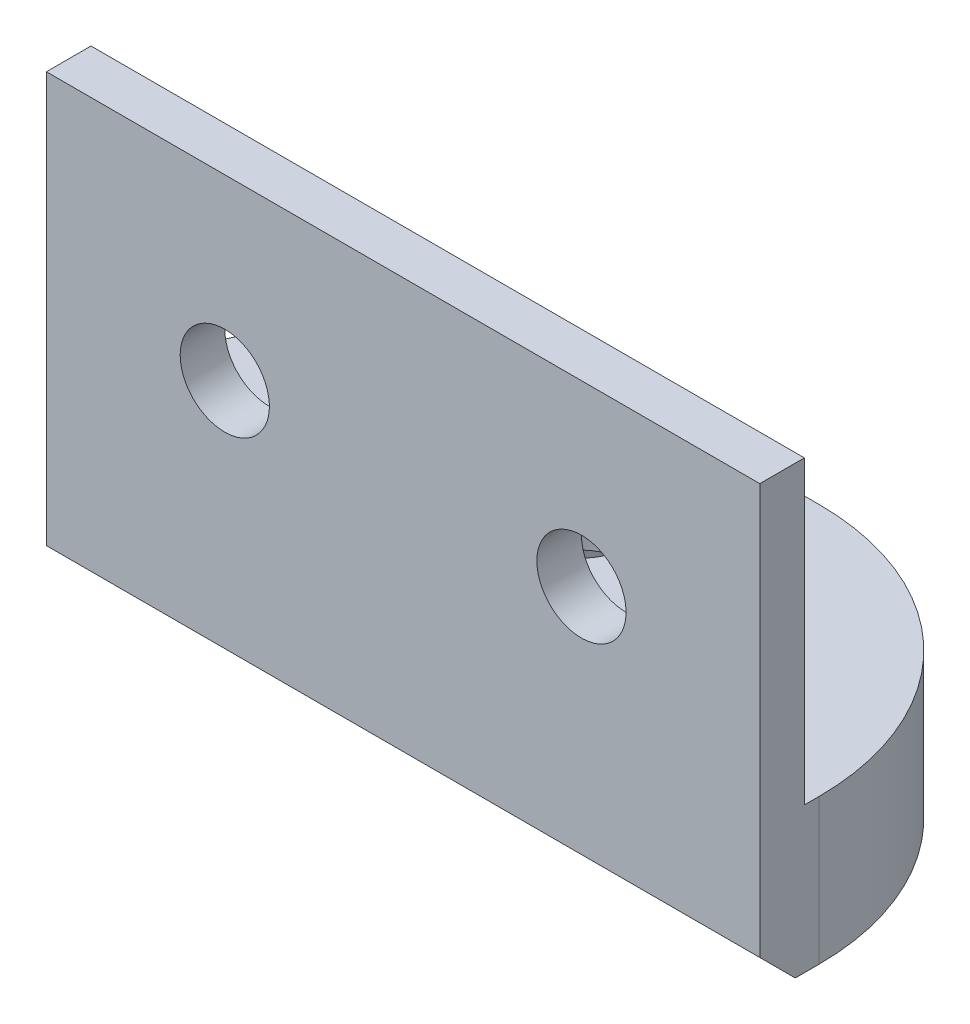
ISO-10303-21;
HEADER;
FILE_DESCRIPTION(('STEP AP214'),'2;1');
FILE_NAME('part.step','',(''),(''),'','','');
FILE_SCHEMA(('AUTOMOTIVE_DESIGN { 1 0 10303 214 1 1 1 1 }'));
ENDSEC;
DATA;
#1=APPLICATION_CONTEXT('core data for automotive mechanical design processes');
#2=APPLICATION_PROTOCOL_DEFINITION('international standard','automotive_design',2000,#1);
#3=PRODUCT_CONTEXT('',#1,'mechanical');
#4=PRODUCT('Part','Part','',(#3));
#5=PRODUCT_RELATED_PRODUCT_CATEGORY('part','',(#4));
#6=PRODUCT_DEFINITION_FORMATION('','',#4);
#7=PRODUCT_DEFINITION_CONTEXT('part definition',#1,'design');
#8=PRODUCT_DEFINITION('design','',#6,#7);
#9=PRODUCT_DEFINITION_SHAPE('','',#8);
#10=(LENGTH_UNIT() NAMED_UNIT(*) SI_UNIT(.MILLI.,.METRE.));
#11=(NAMED_UNIT(*) PLANE_ANGLE_UNIT() SI_UNIT($,.RADIAN.));
#12=(NAMED_UNIT(*) SI_UNIT($,.STERADIAN.) SOLID_ANGLE_UNIT());
#13=UNCERTAINTY_MEASURE_WITH_UNIT(LENGTH_MEASURE(1.E-05),#10,'distance_accuracy_value','');
#14=(GEOMETRIC_REPRESENTATION_CONTEXT(3) GLOBAL_UNCERTAINTY_ASSIGNED_CONTEXT((#13)) GLOBAL_UNIT_ASSIGNED_CONTEXT((#10,
#11,#12)) REPRESENTATION_CONTEXT('',''));
#15=CARTESIAN_POINT('',(0.,0.,0.));
#16=DIRECTION('',(0.,0.,1.));
#17=DIRECTION('',(1.,0.,0.));
#18=AXIS2_PLACEMENT_3D('',#15,#16,#17);
#19=CARTESIAN_POINT('',(0.,0.,0.));
#20=DIRECTION('',(0.,0.,-1.));
#21=DIRECTION('',(-1.,0.,0.));
#22=AXIS2_PLACEMENT_3D('',#19,#20,#21);
#23=PLANE('',#22);
#24=CARTESIAN_POINT('',(12.7,0.,0.));
#25=DIRECTION('',(0.,0.,-1.));
#26=DIRECTION('',(-1.,0.,0.));
#27=AXIS2_PLACEMENT_3D('',#24,#25,#26);
#28=CIRCLE('',#27,3.17499999999999);
#29=CARTESIAN_POINT('',(9.52499999999999,0.,0.));
#30=VERTEX_POINT('',#29);
#31=EDGE_CURVE('E253',#30,#30,#28,.T.);
#32=ORIENTED_EDGE('',*,*,#31,.F.);
#33=EDGE_LOOP('',(#32));
#34=FACE_BOUND('',#33,.T.);
#35=CARTESIAN_POINT('',(-12.7,0.,0.));
#36=DIRECTION('',(0.,0.,-1.));
#37=DIRECTION('',(-1.,0.,0.));
#38=AXIS2_PLACEMENT_3D('',#35,#36,#37);
#39=CIRCLE('',#38,3.17499999999999);
#40=CARTESIAN_POINT('',(-15.875,0.,0.));
#41=VERTEX_POINT('',#40);
#42=EDGE_CURVE('E261',#41,#41,#39,.T.);
#43=ORIENTED_EDGE('',*,*,#42,.F.);
#44=EDGE_LOOP('',(#43));
#45=FACE_BOUND('',#44,.T.);
#46=DIRECTION('',(0.,1.,0.));
#47=VECTOR('',#46,1.);
#48=CARTESIAN_POINT('',(25.4,-12.7,0.));
#49=LINE('',#48,#47);
#50=CARTESIAN_POINT('',(25.4,-8.7,0.));
#51=VERTEX_POINT('',#50);
#52=CARTESIAN_POINT('',(25.4,12.7,0.));
#53=VERTEX_POINT('',#52);
#54=EDGE_CURVE('E274',#51,#53,#49,.T.);
#55=ORIENTED_EDGE('',*,*,#54,.F.);
#56=DIRECTION('',(-1.,0.,0.));
#57=VECTOR('',#56,1.);
#58=CARTESIAN_POINT('',(0.,-8.7,0.));
#59=LINE('',#58,#57);
#60=CARTESIAN_POINT('',(-25.4,-8.7,0.));
#61=VERTEX_POINT('',#60);
#62=EDGE_CURVE('E219',#51,#61,#59,.T.);
#63=ORIENTED_EDGE('',*,*,#62,.T.);
#64=DIRECTION('',(0.,1.,0.));
#65=VECTOR('',#64,1.);
#66=CARTESIAN_POINT('',(-25.4,-12.7,0.));
#67=LINE('',#66,#65);
#68=CARTESIAN_POINT('',(-25.4,12.7,0.));
#69=VERTEX_POINT('',#68);
#70=EDGE_CURVE('E284',#61,#69,#67,.T.);
#71=ORIENTED_EDGE('',*,*,#70,.T.);
#72=DIRECTION('',(-1.,0.,0.));
#73=VECTOR('',#72,1.);
#74=CARTESIAN_POINT('',(25.4,12.7,0.));
#75=LINE('',#74,#73);
#76=EDGE_CURVE('E269',#53,#69,#75,.T.);
#77=ORIENTED_EDGE('',*,*,#76,.F.);
#78=EDGE_LOOP('',(#55,#63,#71,#77));
#79=FACE_BOUND('',#78,.T.);
#80=ADVANCED_FACE('F43',(#34,#45,#79),#23,.T.);
#81=CARTESIAN_POINT('',(25.4,12.7,3.175));
#82=DIRECTION('',(0.,-1.,0.));
#83=DIRECTION('',(1.,0.,0.));
#84=AXIS2_PLACEMENT_3D('',#81,#82,#83);
#85=PLANE('',#84);
#86=ORIENTED_EDGE('',*,*,#76,.T.);
#87=DIRECTION('',(0.,0.,-1.));
#88=VECTOR('',#87,1.);
#89=CARTESIAN_POINT('',(-25.4,12.7,3.175));
#90=LINE('',#89,#88);
#91=CARTESIAN_POINT('',(-25.4,12.7,3.175));
#92=VERTEX_POINT('',#91);
#93=EDGE_CURVE('E292',#92,#69,#90,.T.);
#94=ORIENTED_EDGE('',*,*,#93,.F.);
#95=DIRECTION('',(-1.,0.,0.));
#96=VECTOR('',#95,1.);
#97=CARTESIAN_POINT('',(25.4,12.7,3.175));
#98=LINE('',#97,#96);
#99=CARTESIAN_POINT('',(25.4,12.7,3.175));
#100=VERTEX_POINT('',#99);
#101=EDGE_CURVE('E270',#100,#92,#98,.T.);
#102=ORIENTED_EDGE('',*,*,#101,.F.);
#103=DIRECTION('',(0.,0.,-1.));
#104=VECTOR('',#103,1.);
#105=CARTESIAN_POINT('',(25.4,12.7,3.175));
#106=LINE('',#105,#104);
#107=EDGE_CURVE('E280',#100,#53,#106,.T.);
#108=ORIENTED_EDGE('',*,*,#107,.T.);
#109=EDGE_LOOP('',(#86,#94,#102,#108));
#110=FACE_BOUND('',#109,.T.);
#111=ADVANCED_FACE('F370',(#110),#85,.F.);
#112=CARTESIAN_POINT('',(-25.4,-12.7,3.175));
#113=DIRECTION('',(-1.,0.,0.));
#114=DIRECTION('',(0.,-1.,0.));
#115=AXIS2_PLACEMENT_3D('',#112,#113,#114);
#116=PLANE('',#115);
#117=DIRECTION('',(0.,0.,1.));
#118=VECTOR('',#117,1.);
#119=CARTESIAN_POINT('',(-25.4,-8.7,-19.05));
#120=LINE('',#119,#118);
#121=CARTESIAN_POINT('',(-25.4,-8.7,-1.05000000000001));
#122=VERTEX_POINT('',#121);
#123=EDGE_CURVE('E250',#122,#61,#120,.T.);
#124=ORIENTED_EDGE('',*,*,#123,.F.);
#125=DIRECTION('',(0.,-1.,0.));
#126=VECTOR('',#125,1.);
#127=CARTESIAN_POINT('',(-25.4,-12.7,-1.05));
#128=LINE('',#127,#126);
#129=CARTESIAN_POINT('',(-25.4,-19.05,-1.05000000000001));
#130=VERTEX_POINT('',#129);
#131=EDGE_CURVE('E296',#122,#130,#128,.T.);
#132=ORIENTED_EDGE('',*,*,#131,.T.);
#133=DIRECTION('',(0.,0.,1.));
#134=VECTOR('',#133,1.);
#135=CARTESIAN_POINT('',(-25.4,-19.05,-19.05));
#136=LINE('',#135,#134);
#137=CARTESIAN_POINT('',(-25.4,-19.05,0.650000000000119));
#138=VERTEX_POINT('',#137);
#139=EDGE_CURVE('E239',#130,#138,#136,.T.);
#140=ORIENTED_EDGE('',*,*,#139,.T.);
#141=DIRECTION('',(0.,0.707106781186551,0.707106781186544));
#142=VECTOR('',#141,1.);
#143=CARTESIAN_POINT('',(-25.4,-19.7000000000001,0.));
#144=LINE('',#143,#142);
#145=CARTESIAN_POINT('',(-25.4,-16.5250000000001,3.175));
#146=VERTEX_POINT('',#145);
#147=EDGE_CURVE('E329',#138,#146,#144,.T.);
#148=ORIENTED_EDGE('',*,*,#147,.T.);
#149=DIRECTION('',(0.,1.,0.));
#150=VECTOR('',#149,1.);
#151=CARTESIAN_POINT('',(-25.4,-12.7,3.175));
#152=LINE('',#151,#150);
#153=EDGE_CURVE('E273',#146,#92,#152,.T.);
#154=ORIENTED_EDGE('',*,*,#153,.T.);
#155=ORIENTED_EDGE('',*,*,#93,.T.);
#156=ORIENTED_EDGE('',*,*,#70,.F.);
#157=EDGE_LOOP('',(#124,#132,#140,#148,#154,#155,#156));
#158=FACE_BOUND('',#157,.T.);
#159=ADVANCED_FACE('F362',(#158),#116,.T.);
#160=CARTESIAN_POINT('',(25.4,-12.7,3.175));
#161=DIRECTION('',(-1.,0.,0.));
#162=DIRECTION('',(0.,0.,1.));
#163=AXIS2_PLACEMENT_3D('',#160,#161,#162);
#164=PLANE('',#163);
#165=DIRECTION('',(0.,0.,1.));
#166=VECTOR('',#165,1.);
#167=CARTESIAN_POINT('',(25.4,-19.05,-19.05));
#168=LINE('',#167,#166);
#169=CARTESIAN_POINT('',(25.4,-19.05,-1.05000000000001));
#170=VERTEX_POINT('',#169);
#171=CARTESIAN_POINT('',(25.4,-19.05,0.65000000000012));
#172=VERTEX_POINT('',#171);
#173=EDGE_CURVE('E60',#170,#172,#168,.T.);
#174=ORIENTED_EDGE('',*,*,#173,.F.);
#175=DIRECTION('',(0.,-1.,0.));
#176=VECTOR('',#175,1.);
#177=CARTESIAN_POINT('',(25.4,-8.7,-1.05));
#178=LINE('',#177,#176);
#179=CARTESIAN_POINT('',(25.4,-8.7,-1.05000000000001));
#180=VERTEX_POINT('',#179);
#181=EDGE_CURVE('E323',#170,#180,#178,.F.);
#182=ORIENTED_EDGE('',*,*,#181,.T.);
#183=DIRECTION('',(0.,0.,1.));
#184=VECTOR('',#183,1.);
#185=CARTESIAN_POINT('',(25.4,-8.7,-19.05));
#186=LINE('',#185,#184);
#187=EDGE_CURVE('E247',#180,#51,#186,.T.);
#188=ORIENTED_EDGE('',*,*,#187,.T.);
#189=ORIENTED_EDGE('',*,*,#54,.T.);
#190=ORIENTED_EDGE('',*,*,#107,.F.);
#191=DIRECTION('',(0.,1.,0.));
#192=VECTOR('',#191,1.);
#193=CARTESIAN_POINT('',(25.4,-12.7,3.175));
#194=LINE('',#193,#192);
#195=CARTESIAN_POINT('',(25.4,-16.5250000000001,3.175));
#196=VERTEX_POINT('',#195);
#197=EDGE_CURVE('E67',#196,#100,#194,.T.);
#198=ORIENTED_EDGE('',*,*,#197,.F.);
#199=DIRECTION('',(0.,-0.707106781186551,-0.707106781186544));
#200=VECTOR('',#199,1.);
#201=CARTESIAN_POINT('',(25.4,-14.6125,5.08750000000004));
#202=LINE('',#201,#200);
#203=EDGE_CURVE('E11',#196,#172,#202,.T.);
#204=ORIENTED_EDGE('',*,*,#203,.T.);
#205=EDGE_LOOP('',(#174,#182,#188,#189,#190,#198,#204));
#206=FACE_BOUND('',#205,.T.);
#207=ADVANCED_FACE('F340',(#206),#164,.F.);
#208=CARTESIAN_POINT('',(0.,0.,3.175));
#209=DIRECTION('',(0.,0.,-1.));
#210=DIRECTION('',(-1.,0.,0.));
#211=AXIS2_PLACEMENT_3D('',#208,#209,#210);
#212=PLANE('',#211);
#213=CARTESIAN_POINT('',(12.7,0.,3.175));
#214=DIRECTION('',(0.,0.,-1.));
#215=DIRECTION('',(-1.,0.,0.));
#216=AXIS2_PLACEMENT_3D('',#213,#214,#215);
#217=CIRCLE('',#216,3.17499999999999);
#218=CARTESIAN_POINT('',(9.52499999999999,0.,3.175));
#219=VERTEX_POINT('',#218);
#220=EDGE_CURVE('E257',#219,#219,#217,.T.);
#221=ORIENTED_EDGE('',*,*,#220,.T.);
#222=EDGE_LOOP('',(#221));
#223=FACE_BOUND('',#222,.T.);
#224=CARTESIAN_POINT('',(-12.7,0.,3.175));
#225=DIRECTION('',(0.,0.,-1.));
#226=DIRECTION('',(-1.,0.,0.));
#227=AXIS2_PLACEMENT_3D('',#224,#225,#226);
#228=CIRCLE('',#227,3.17499999999999);
#229=CARTESIAN_POINT('',(-15.875,0.,3.175));
#230=VERTEX_POINT('',#229);
#231=EDGE_CURVE('E265',#230,#230,#228,.T.);
#232=ORIENTED_EDGE('',*,*,#231,.T.);
#233=EDGE_LOOP('',(#232));
#234=FACE_BOUND('',#233,.T.);
#235=ORIENTED_EDGE('',*,*,#101,.T.);
#236=ORIENTED_EDGE('',*,*,#153,.F.);
#237=DIRECTION('',(1.,0.,0.));
#238=VECTOR('',#237,1.);
#239=CARTESIAN_POINT('',(0.,-16.5250000000001,3.175));
#240=LINE('',#239,#238);
#241=EDGE_CURVE('E53',#146,#196,#240,.T.);
#242=ORIENTED_EDGE('',*,*,#241,.T.);
#243=ORIENTED_EDGE('',*,*,#197,.T.);
#244=EDGE_LOOP('',(#235,#236,#242,#243));
#245=FACE_BOUND('',#244,.T.);
#246=ADVANCED_FACE('F336',(#223,#234,#245),#212,.F.);
#247=CARTESIAN_POINT('',(-12.7,0.,0.));
#248=DIRECTION('',(0.,0.,-1.));
#249=DIRECTION('',(-1.,0.,0.));
#250=AXIS2_PLACEMENT_3D('',#247,#248,#249);
#251=CYLINDRICAL_SURFACE('',#250,3.17499999999999);
#252=ORIENTED_EDGE('',*,*,#231,.F.);
#253=EDGE_LOOP('',(#252));
#254=FACE_BOUND('',#253,.T.);
#255=ORIENTED_EDGE('',*,*,#42,.T.);
#256=EDGE_LOOP('',(#255));
#257=FACE_BOUND('',#256,.T.);
#258=ADVANCED_FACE('F423',(#254,#257),#251,.F.);
#259=CARTESIAN_POINT('',(12.7,0.,0.));
#260=DIRECTION('',(0.,0.,-1.));
#261=DIRECTION('',(-1.,0.,0.));
#262=AXIS2_PLACEMENT_3D('',#259,#260,#261);
#263=CYLINDRICAL_SURFACE('',#262,3.17499999999999);
#264=ORIENTED_EDGE('',*,*,#220,.F.);
#265=EDGE_LOOP('',(#264));
#266=FACE_BOUND('',#265,.T.);
#267=ORIENTED_EDGE('',*,*,#31,.T.);
#268=EDGE_LOOP('',(#267));
#269=FACE_BOUND('',#268,.T.);
#270=ADVANCED_FACE('F380',(#266,#269),#263,.F.);
#271=CARTESIAN_POINT('',(0.,-8.7,-19.05));
#272=DIRECTION('',(0.,1.,0.));
#273=DIRECTION('',(0.,0.,1.));
#274=AXIS2_PLACEMENT_3D('',#271,#272,#273);
#275=PLANE('',#274);
#276=CARTESIAN_POINT('',(0.,-8.7,-9.525));
#277=DIRECTION('',(0.,1.,0.));
#278=DIRECTION('',(0.,0.,1.));
#279=AXIS2_PLACEMENT_3D('',#276,#277,#278);
#280=CIRCLE('',#279,3.17499999999999);
#281=CARTESIAN_POINT('',(0.,-8.7,-6.35000000000002));
#282=VERTEX_POINT('',#281);
#283=EDGE_CURVE('E187',#282,#282,#280,.T.);
#284=ORIENTED_EDGE('',*,*,#283,.F.);
#285=EDGE_LOOP('',(#284));
#286=FACE_BOUND('',#285,.T.);
#287=DIRECTION('',(-1.,0.,0.));
#288=VECTOR('',#287,1.);
#289=CARTESIAN_POINT('',(0.,-8.7,-19.05));
#290=LINE('',#289,#288);
#291=CARTESIAN_POINT('',(7.39999999999998,-8.7,-19.05));
#292=VERTEX_POINT('',#291);
#293=CARTESIAN_POINT('',(-7.40000000000002,-8.7,-19.05));
#294=VERTEX_POINT('',#293);
#295=EDGE_CURVE('E231',#292,#294,#290,.T.);
#296=ORIENTED_EDGE('',*,*,#295,.T.);
#297=CARTESIAN_POINT('',(-7.40000000000002,-8.7,-1.05));
#298=DIRECTION('',(0.,1.,0.));
#299=DIRECTION('',(0.,0.,1.));
#300=AXIS2_PLACEMENT_3D('',#297,#298,#299);
#301=CIRCLE('',#300,18.);
#302=EDGE_CURVE('E320',#294,#122,#301,.T.);
#303=ORIENTED_EDGE('',*,*,#302,.T.);
#304=ORIENTED_EDGE('',*,*,#123,.T.);
#305=ORIENTED_EDGE('',*,*,#62,.F.);
#306=ORIENTED_EDGE('',*,*,#187,.F.);
#307=CARTESIAN_POINT('',(7.39999999999998,-8.7,-1.05));
#308=DIRECTION('',(0.,1.,0.));
#309=DIRECTION('',(0.,0.,1.));
#310=AXIS2_PLACEMENT_3D('',#307,#308,#309);
#311=CIRCLE('',#310,18.);
#312=EDGE_CURVE('E317',#180,#292,#311,.T.);
#313=ORIENTED_EDGE('',*,*,#312,.T.);
#314=EDGE_LOOP('',(#296,#303,#304,#305,#306,#313));
#315=FACE_BOUND('',#314,.T.);
#316=ADVANCED_FACE('F349',(#286,#315),#275,.T.);
#317=CARTESIAN_POINT('',(0.,-19.05,-19.05));
#318=DIRECTION('',(0.,1.,0.));
#319=DIRECTION('',(0.,0.,1.));
#320=AXIS2_PLACEMENT_3D('',#317,#318,#319);
#321=PLANE('',#320);
#322=DIRECTION('',(1.,0.,0.));
#323=VECTOR('',#322,1.);
#324=CARTESIAN_POINT('',(-3.29955678841873,-19.05,-15.24));
#325=LINE('',#324,#323);
#326=CARTESIAN_POINT('',(-3.29955678841873,-19.05,-15.24));
#327=VERTEX_POINT('',#326);
#328=CARTESIAN_POINT('',(3.29955678841869,-19.05,-15.24));
#329=VERTEX_POINT('',#328);
#330=EDGE_CURVE('E202',#327,#329,#325,.T.);
#331=ORIENTED_EDGE('',*,*,#330,.F.);
#332=DIRECTION('',(0.5,0.,-0.866025403784438));
#333=VECTOR('',#332,1.);
#334=CARTESIAN_POINT('',(-6.59911357683744,-19.05,-9.525));
#335=LINE('',#334,#333);
#336=CARTESIAN_POINT('',(-6.59911357683744,-19.05,-9.525));
#337=VERTEX_POINT('',#336);
#338=EDGE_CURVE('E159',#337,#327,#335,.T.);
#339=ORIENTED_EDGE('',*,*,#338,.F.);
#340=DIRECTION('',(-0.5,0.,-0.866025403784439));
#341=VECTOR('',#340,1.);
#342=CARTESIAN_POINT('',(-3.29955678841873,-19.05,-3.81000000000001));
#343=LINE('',#342,#341);
#344=CARTESIAN_POINT('',(-3.29955678841873,-19.05,-3.81000000000001));
#345=VERTEX_POINT('',#344);
#346=EDGE_CURVE('E180',#345,#337,#343,.T.);
#347=ORIENTED_EDGE('',*,*,#346,.F.);
#348=DIRECTION('',(-1.,0.,0.));
#349=VECTOR('',#348,1.);
#350=CARTESIAN_POINT('',(3.29955678841869,-19.05,-3.81));
#351=LINE('',#350,#349);
#352=CARTESIAN_POINT('',(3.29955678841869,-19.05,-3.81));
#353=VERTEX_POINT('',#352);
#354=EDGE_CURVE('E184',#353,#345,#351,.T.);
#355=ORIENTED_EDGE('',*,*,#354,.F.);
#356=DIRECTION('',(-0.500000000000001,0.,0.866025403784438));
#357=VECTOR('',#356,1.);
#358=CARTESIAN_POINT('',(6.5991135768374,-19.05,-9.525));
#359=LINE('',#358,#357);
#360=CARTESIAN_POINT('',(6.5991135768374,-19.05,-9.525));
#361=VERTEX_POINT('',#360);
#362=EDGE_CURVE('E209',#361,#353,#359,.T.);
#363=ORIENTED_EDGE('',*,*,#362,.F.);
#364=DIRECTION('',(0.5,0.,0.866025403784439));
#365=VECTOR('',#364,1.);
#366=CARTESIAN_POINT('',(3.29955678841869,-19.05,-15.24));
#367=LINE('',#366,#365);
#368=EDGE_CURVE('E205',#329,#361,#367,.T.);
#369=ORIENTED_EDGE('',*,*,#368,.F.);
#370=EDGE_LOOP('',(#331,#339,#347,#355,#363,#369));
#371=FACE_BOUND('',#370,.T.);
#372=ORIENTED_EDGE('',*,*,#139,.F.);
#373=CARTESIAN_POINT('',(-7.40000000000002,-19.05,-1.05));
#374=DIRECTION('',(0.,1.,0.));
#375=DIRECTION('',(0.,0.,1.));
#376=AXIS2_PLACEMENT_3D('',#373,#374,#375);
#377=CIRCLE('',#376,18.);
#378=CARTESIAN_POINT('',(-7.40000000000002,-19.05,-19.05));
#379=VERTEX_POINT('',#378);
#380=EDGE_CURVE('E307',#130,#379,#377,.F.);
#381=ORIENTED_EDGE('',*,*,#380,.T.);
#382=DIRECTION('',(-1.,0.,0.));
#383=VECTOR('',#382,1.);
#384=CARTESIAN_POINT('',(0.,-19.05,-19.05));
#385=LINE('',#384,#383);
#386=CARTESIAN_POINT('',(7.39999999999998,-19.05,-19.05));
#387=VERTEX_POINT('',#386);
#388=EDGE_CURVE('E235',#387,#379,#385,.T.);
#389=ORIENTED_EDGE('',*,*,#388,.F.);
#390=CARTESIAN_POINT('',(7.39999999999998,-19.05,-1.05));
#391=DIRECTION('',(0.,1.,0.));
#392=DIRECTION('',(0.,0.,1.));
#393=AXIS2_PLACEMENT_3D('',#390,#391,#392);
#394=CIRCLE('',#393,18.);
#395=EDGE_CURVE('E304',#387,#170,#394,.F.);
#396=ORIENTED_EDGE('',*,*,#395,.T.);
#397=ORIENTED_EDGE('',*,*,#173,.T.);
#398=DIRECTION('',(-1.,0.,0.));
#399=VECTOR('',#398,1.);
#400=CARTESIAN_POINT('',(0.,-19.05,0.650000000000123));
#401=LINE('',#400,#399);
#402=EDGE_CURVE('E326',#172,#138,#401,.T.);
#403=ORIENTED_EDGE('',*,*,#402,.T.);
#404=EDGE_LOOP('',(#372,#381,#389,#396,#397,#403));
#405=FACE_BOUND('',#404,.T.);
#406=ADVANCED_FACE('F371',(#371,#405),#321,.F.);
#407=CARTESIAN_POINT('',(0.,0.,-19.05));
#408=DIRECTION('',(0.,0.,-1.));
#409=DIRECTION('',(-1.,0.,0.));
#410=AXIS2_PLACEMENT_3D('',#407,#408,#409);
#411=PLANE('',#410);
#412=ORIENTED_EDGE('',*,*,#388,.T.);
#413=DIRECTION('',(0.,-1.,0.));
#414=VECTOR('',#413,1.);
#415=CARTESIAN_POINT('',(-7.40000000000002,0.,-19.05));
#416=LINE('',#415,#414);
#417=EDGE_CURVE('E314',#379,#294,#416,.F.);
#418=ORIENTED_EDGE('',*,*,#417,.T.);
#419=ORIENTED_EDGE('',*,*,#295,.F.);
#420=DIRECTION('',(0.,-1.,0.));
#421=VECTOR('',#420,1.);
#422=CARTESIAN_POINT('',(7.39999999999998,-19.05,-19.05));
#423=LINE('',#422,#421);
#424=EDGE_CURVE('E310',#292,#387,#423,.T.);
#425=ORIENTED_EDGE('',*,*,#424,.T.);
#426=EDGE_LOOP('',(#412,#418,#419,#425));
#427=FACE_BOUND('',#426,.T.);
#428=ADVANCED_FACE('F353',(#427),#411,.T.);
#429=CARTESIAN_POINT('',(-6.59911357683744,-12.7,-9.525));
#430=DIRECTION('',(-0.866025403784439,0.,-0.5));
#431=DIRECTION('',(-0.5,0.,0.866025403784439));
#432=AXIS2_PLACEMENT_3D('',#429,#430,#431);
#433=PLANE('',#432);
#434=ORIENTED_EDGE('',*,*,#338,.T.);
#435=DIRECTION('',(0.,-1.,0.));
#436=VECTOR('',#435,1.);
#437=CARTESIAN_POINT('',(-3.29955678841873,-12.7,-15.24));
#438=LINE('',#437,#436);
#439=CARTESIAN_POINT('',(-3.29955678841873,-12.7,-15.24));
#440=VERTEX_POINT('',#439);
#441=EDGE_CURVE('E152',#440,#327,#438,.T.);
#442=ORIENTED_EDGE('',*,*,#441,.F.);
#443=DIRECTION('',(0.5,0.,-0.866025403784438));
#444=VECTOR('',#443,1.);
#445=CARTESIAN_POINT('',(-6.59911357683744,-12.7,-9.525));
#446=LINE('',#445,#444);
#447=CARTESIAN_POINT('',(-6.59911357683744,-12.7,-9.525));
#448=VERTEX_POINT('',#447);
#449=EDGE_CURVE('E156',#448,#440,#446,.T.);
#450=ORIENTED_EDGE('',*,*,#449,.F.);
#451=DIRECTION('',(0.,-1.,0.));
#452=VECTOR('',#451,1.);
#453=CARTESIAN_POINT('',(-6.59911357683744,-12.7,-9.525));
#454=LINE('',#453,#452);
#455=EDGE_CURVE('E216',#448,#337,#454,.T.);
#456=ORIENTED_EDGE('',*,*,#455,.T.);
#457=EDGE_LOOP('',(#434,#442,#450,#456));
#458=FACE_BOUND('',#457,.T.);
#459=ADVANCED_FACE('F154',(#458),#433,.F.);
#460=CARTESIAN_POINT('',(-3.29955678841873,-12.7,-3.81000000000001));
#461=DIRECTION('',(-0.866025403784439,0.,0.5));
#462=DIRECTION('',(0.5,0.,0.866025403784439));
#463=AXIS2_PLACEMENT_3D('',#460,#461,#462);
#464=PLANE('',#463);
#465=ORIENTED_EDGE('',*,*,#346,.T.);
#466=ORIENTED_EDGE('',*,*,#455,.F.);
#467=DIRECTION('',(-0.5,0.,-0.866025403784439));
#468=VECTOR('',#467,1.);
#469=CARTESIAN_POINT('',(-3.29955678841873,-12.7,-3.81000000000001));
#470=LINE('',#469,#468);
#471=CARTESIAN_POINT('',(-3.29955678841873,-12.7,-3.81000000000001));
#472=VERTEX_POINT('',#471);
#473=EDGE_CURVE('E165',#472,#448,#470,.T.);
#474=ORIENTED_EDGE('',*,*,#473,.F.);
#475=DIRECTION('',(0.,-1.,0.));
#476=VECTOR('',#475,1.);
#477=CARTESIAN_POINT('',(-3.29955678841873,-12.7,-3.81000000000001));
#478=LINE('',#477,#476);
#479=EDGE_CURVE('E220',#472,#345,#478,.T.);
#480=ORIENTED_EDGE('',*,*,#479,.T.);
#481=EDGE_LOOP('',(#465,#466,#474,#480));
#482=FACE_BOUND('',#481,.T.);
#483=ADVANCED_FACE('F520',(#482),#464,.F.);
#484=CARTESIAN_POINT('',(3.29955678841869,-12.7,-3.81));
#485=DIRECTION('',(0.,0.,1.));
#486=DIRECTION('',(1.,0.,0.));
#487=AXIS2_PLACEMENT_3D('',#484,#485,#486);
#488=PLANE('',#487);
#489=ORIENTED_EDGE('',*,*,#354,.T.);
#490=ORIENTED_EDGE('',*,*,#479,.F.);
#491=DIRECTION('',(-1.,0.,0.));
#492=VECTOR('',#491,1.);
#493=CARTESIAN_POINT('',(3.29955678841869,-12.7,-3.81));
#494=LINE('',#493,#492);
#495=CARTESIAN_POINT('',(3.29955678841869,-12.7,-3.81));
#496=VERTEX_POINT('',#495);
#497=EDGE_CURVE('E195',#496,#472,#494,.T.);
#498=ORIENTED_EDGE('',*,*,#497,.F.);
#499=DIRECTION('',(0.,-1.,0.));
#500=VECTOR('',#499,1.);
#501=CARTESIAN_POINT('',(3.29955678841869,-12.7,-3.81));
#502=LINE('',#501,#500);
#503=EDGE_CURVE('E223',#496,#353,#502,.T.);
#504=ORIENTED_EDGE('',*,*,#503,.T.);
#505=EDGE_LOOP('',(#489,#490,#498,#504));
#506=FACE_BOUND('',#505,.T.);
#507=ADVANCED_FACE('F510',(#506),#488,.F.);
#508=CARTESIAN_POINT('',(6.5991135768374,-12.7,-9.525));
#509=DIRECTION('',(0.866025403784438,0.,0.500000000000001));
#510=DIRECTION('',(0.500000000000001,0.,-0.866025403784438));
#511=AXIS2_PLACEMENT_3D('',#508,#509,#510);
#512=PLANE('',#511);
#513=ORIENTED_EDGE('',*,*,#362,.T.);
#514=ORIENTED_EDGE('',*,*,#503,.F.);
#515=DIRECTION('',(-0.500000000000001,0.,0.866025403784438));
#516=VECTOR('',#515,1.);
#517=CARTESIAN_POINT('',(6.5991135768374,-12.7,-9.525));
#518=LINE('',#517,#516);
#519=CARTESIAN_POINT('',(6.5991135768374,-12.7,-9.525));
#520=VERTEX_POINT('',#519);
#521=EDGE_CURVE('E191',#520,#496,#518,.T.);
#522=ORIENTED_EDGE('',*,*,#521,.F.);
#523=DIRECTION('',(0.,-1.,0.));
#524=VECTOR('',#523,1.);
#525=CARTESIAN_POINT('',(6.5991135768374,-12.7,-9.525));
#526=LINE('',#525,#524);
#527=EDGE_CURVE('E226',#520,#361,#526,.T.);
#528=ORIENTED_EDGE('',*,*,#527,.T.);
#529=EDGE_LOOP('',(#513,#514,#522,#528));
#530=FACE_BOUND('',#529,.T.);
#531=ADVANCED_FACE('F500',(#530),#512,.F.);
#532=CARTESIAN_POINT('',(3.29955678841869,-12.7,-15.24));
#533=DIRECTION('',(0.866025403784439,0.,-0.5));
#534=DIRECTION('',(-0.5,0.,-0.866025403784439));
#535=AXIS2_PLACEMENT_3D('',#532,#533,#534);
#536=PLANE('',#535);
#537=ORIENTED_EDGE('',*,*,#368,.T.);
#538=ORIENTED_EDGE('',*,*,#527,.F.);
#539=DIRECTION('',(0.5,0.,0.866025403784439));
#540=VECTOR('',#539,1.);
#541=CARTESIAN_POINT('',(3.29955678841869,-12.7,-15.24));
#542=LINE('',#541,#540);
#543=CARTESIAN_POINT('',(3.29955678841869,-12.7,-15.24));
#544=VERTEX_POINT('',#543);
#545=EDGE_CURVE('E174',#544,#520,#542,.T.);
#546=ORIENTED_EDGE('',*,*,#545,.F.);
#547=DIRECTION('',(0.,-1.,0.));
#548=VECTOR('',#547,1.);
#549=CARTESIAN_POINT('',(3.29955678841869,-12.7,-15.24));
#550=LINE('',#549,#548);
#551=EDGE_CURVE('E164',#544,#329,#550,.T.);
#552=ORIENTED_EDGE('',*,*,#551,.T.);
#553=EDGE_LOOP('',(#537,#538,#546,#552));
#554=FACE_BOUND('',#553,.T.);
#555=ADVANCED_FACE('F491',(#554),#536,.F.);
#556=CARTESIAN_POINT('',(-3.29955678841873,-12.7,-15.24));
#557=DIRECTION('',(0.,0.,-1.));
#558=DIRECTION('',(-1.,0.,0.));
#559=AXIS2_PLACEMENT_3D('',#556,#557,#558);
#560=PLANE('',#559);
#561=ORIENTED_EDGE('',*,*,#330,.T.);
#562=ORIENTED_EDGE('',*,*,#551,.F.);
#563=DIRECTION('',(1.,0.,0.));
#564=VECTOR('',#563,1.);
#565=CARTESIAN_POINT('',(-3.29955678841873,-12.7,-15.24));
#566=LINE('',#565,#564);
#567=EDGE_CURVE('E168',#440,#544,#566,.T.);
#568=ORIENTED_EDGE('',*,*,#567,.F.);
#569=ORIENTED_EDGE('',*,*,#441,.T.);
#570=EDGE_LOOP('',(#561,#562,#568,#569));
#571=FACE_BOUND('',#570,.T.);
#572=ADVANCED_FACE('F169',(#571),#560,.F.);
#573=CARTESIAN_POINT('',(0.,-12.7,0.));
#574=DIRECTION('',(0.,-1.,0.));
#575=DIRECTION('',(0.,0.,-1.));
#576=AXIS2_PLACEMENT_3D('',#573,#574,#575);
#577=PLANE('',#576);
#578=CARTESIAN_POINT('',(0.,-12.7,-9.525));
#579=DIRECTION('',(0.,-1.,0.));
#580=DIRECTION('',(0.,0.,-1.));
#581=AXIS2_PLACEMENT_3D('',#578,#579,#580);
#582=CIRCLE('',#581,3.17499999999999);
#583=CARTESIAN_POINT('',(0.,-12.7,-12.7));
#584=VERTEX_POINT('',#583);
#585=EDGE_CURVE('E297',#584,#584,#582,.T.);
#586=ORIENTED_EDGE('',*,*,#585,.F.);
#587=EDGE_LOOP('',(#586));
#588=FACE_BOUND('',#587,.T.);
#589=ORIENTED_EDGE('',*,*,#449,.T.);
#590=ORIENTED_EDGE('',*,*,#567,.T.);
#591=ORIENTED_EDGE('',*,*,#545,.T.);
#592=ORIENTED_EDGE('',*,*,#521,.T.);
#593=ORIENTED_EDGE('',*,*,#497,.T.);
#594=ORIENTED_EDGE('',*,*,#473,.T.);
#595=EDGE_LOOP('',(#589,#590,#591,#592,#593,#594));
#596=FACE_BOUND('',#595,.T.);
#597=ADVANCED_FACE('F176',(#588,#596),#577,.T.);
#598=CARTESIAN_POINT('',(0.,-19.05,-9.525));
#599=DIRECTION('',(0.,-1.,0.));
#600=DIRECTION('',(0.,0.,-1.));
#601=AXIS2_PLACEMENT_3D('',#598,#599,#600);
#602=CYLINDRICAL_SURFACE('',#601,3.17499999999999);
#603=ORIENTED_EDGE('',*,*,#283,.T.);
#604=EDGE_LOOP('',(#603));
#605=FACE_BOUND('',#604,.T.);
#606=ORIENTED_EDGE('',*,*,#585,.T.);
#607=EDGE_LOOP('',(#606));
#608=FACE_BOUND('',#607,.T.);
#609=ADVANCED_FACE('F400',(#605,#608),#602,.F.);
#610=CARTESIAN_POINT('',(-7.40000000000002,-12.7,-1.05));
#611=DIRECTION('',(0.,-1.,0.));
#612=DIRECTION('',(1.,0.,0.));
#613=AXIS2_PLACEMENT_3D('',#610,#611,#612);
#614=CYLINDRICAL_SURFACE('',#613,18.);
#615=ORIENTED_EDGE('',*,*,#302,.F.);
#616=ORIENTED_EDGE('',*,*,#417,.F.);
#617=ORIENTED_EDGE('',*,*,#380,.F.);
#618=ORIENTED_EDGE('',*,*,#131,.F.);
#619=EDGE_LOOP('',(#615,#616,#617,#618));
#620=FACE_BOUND('',#619,.T.);
#621=ADVANCED_FACE('F357',(#620),#614,.T.);
#622=CARTESIAN_POINT('',(7.39999999999998,0.,-1.05));
#623=DIRECTION('',(0.,1.,0.));
#624=DIRECTION('',(0.,0.,1.));
#625=AXIS2_PLACEMENT_3D('',#622,#623,#624);
#626=CYLINDRICAL_SURFACE('',#625,18.);
#627=ORIENTED_EDGE('',*,*,#312,.F.);
#628=ORIENTED_EDGE('',*,*,#181,.F.);
#629=ORIENTED_EDGE('',*,*,#395,.F.);
#630=ORIENTED_EDGE('',*,*,#424,.F.);
#631=EDGE_LOOP('',(#627,#628,#629,#630));
#632=FACE_BOUND('',#631,.T.);
#633=ADVANCED_FACE('F345',(#632),#626,.T.);
#634=CARTESIAN_POINT('',(0.,-19.7000000000001,0.));
#635=DIRECTION('',(0.,0.707106781186544,-0.707106781186551));
#636=DIRECTION('',(-1.,0.,0.));
#637=AXIS2_PLACEMENT_3D('',#634,#635,#636);
#638=PLANE('',#637);
#639=ORIENTED_EDGE('',*,*,#203,.F.);
#640=ORIENTED_EDGE('',*,*,#241,.F.);
#641=ORIENTED_EDGE('',*,*,#147,.F.);
#642=ORIENTED_EDGE('',*,*,#402,.F.);
#643=EDGE_LOOP('',(#639,#640,#641,#642));
#644=FACE_BOUND('',#643,.T.);
#645=ADVANCED_FACE('F46',(#644),#638,.F.);
#646=CLOSED_SHELL('',(#80,#111,#159,#207,#246,#258,#270,#316,#406,#428,#459,#483,#507,#531,#555,
#572,#597,#609,#621,#633,#645));
#647=MANIFOLD_SOLID_BREP('B2',#646);
#648=ADVANCED_BREP_SHAPE_REPRESENTATION('',(#18,#647),#14);
#649=SHAPE_DEFINITION_REPRESENTATION(#9,#648);
ENDSEC;
END-ISO-10303-21;
